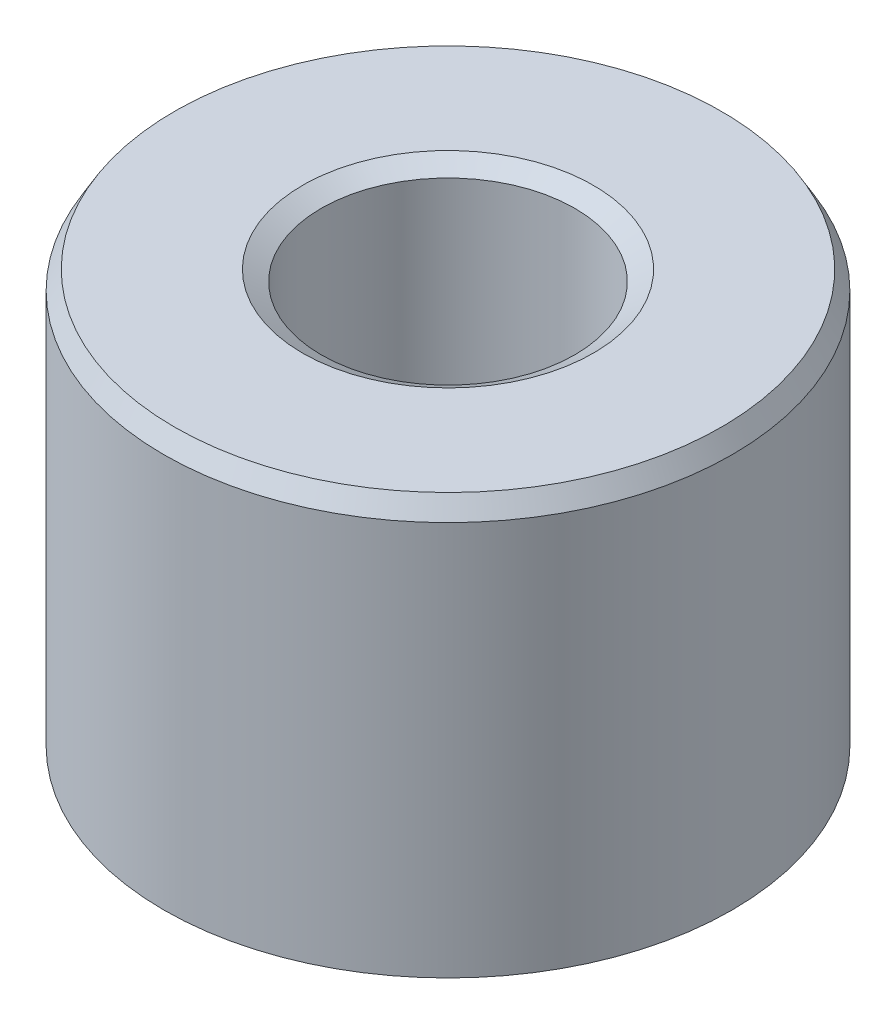
ISO-10303-21;
HEADER;
FILE_DESCRIPTION(('STEP AP214'),'2;1');
FILE_NAME('part.step','',(''),(''),'','','');
FILE_SCHEMA(('AUTOMOTIVE_DESIGN { 1 0 10303 214 1 1 1 1 }'));
ENDSEC;
DATA;
#1=APPLICATION_CONTEXT('core data for automotive mechanical design processes');
#2=APPLICATION_PROTOCOL_DEFINITION('international standard','automotive_design',2000,#1);
#3=PRODUCT_CONTEXT('',#1,'mechanical');
#4=PRODUCT('Part','Part','',(#3));
#5=PRODUCT_RELATED_PRODUCT_CATEGORY('part','',(#4));
#6=PRODUCT_DEFINITION_FORMATION('','',#4);
#7=PRODUCT_DEFINITION_CONTEXT('part definition',#1,'design');
#8=PRODUCT_DEFINITION('design','',#6,#7);
#9=PRODUCT_DEFINITION_SHAPE('','',#8);
#10=(LENGTH_UNIT() NAMED_UNIT(*) SI_UNIT(.MILLI.,.METRE.));
#11=(NAMED_UNIT(*) PLANE_ANGLE_UNIT() SI_UNIT($,.RADIAN.));
#12=(NAMED_UNIT(*) SI_UNIT($,.STERADIAN.) SOLID_ANGLE_UNIT());
#13=UNCERTAINTY_MEASURE_WITH_UNIT(LENGTH_MEASURE(1.E-05),#10,'distance_accuracy_value','');
#14=(GEOMETRIC_REPRESENTATION_CONTEXT(3) GLOBAL_UNCERTAINTY_ASSIGNED_CONTEXT((#13)) GLOBAL_UNIT_ASSIGNED_CONTEXT((#10,
#11,#12)) REPRESENTATION_CONTEXT('',''));
#15=CARTESIAN_POINT('',(0.,0.,0.));
#16=DIRECTION('',(0.,0.,1.));
#17=DIRECTION('',(1.,0.,0.));
#18=AXIS2_PLACEMENT_3D('',#15,#16,#17);
#19=CARTESIAN_POINT('',(0.,74.5253771979332,0.));
#20=DIRECTION('',(0.,-1.,0.));
#21=DIRECTION('',(0.,0.,-1.));
#22=AXIS2_PLACEMENT_3D('',#19,#20,#21);
#23=CYLINDRICAL_SURFACE('',#22,50.);
#24=CARTESIAN_POINT('',(0.,1.88266852770692,0.));
#25=DIRECTION('',(0.,1.,0.));
#26=DIRECTION('',(0.,0.,1.));
#27=AXIS2_PLACEMENT_3D('',#24,#25,#26);
#28=CIRCLE('',#27,50.);
#29=CARTESIAN_POINT('',(0.,1.88266852770692,50.));
#30=VERTEX_POINT('',#29);
#31=EDGE_CURVE('E10',#30,#30,#28,.T.);
#32=ORIENTED_EDGE('',*,*,#31,.T.);
#33=EDGE_LOOP('',(#32));
#34=FACE_BOUND('',#33,.T.);
#35=CARTESIAN_POINT('',(0.,71.2644996541339,0.));
#36=DIRECTION('',(0.,1.,0.));
#37=DIRECTION('',(0.,0.,1.));
#38=AXIS2_PLACEMENT_3D('',#35,#36,#37);
#39=CIRCLE('',#38,50.);
#40=CARTESIAN_POINT('',(0.,71.2644996541339,50.));
#41=VERTEX_POINT('',#40);
#42=EDGE_CURVE('E50',#41,#41,#39,.F.);
#43=ORIENTED_EDGE('',*,*,#42,.T.);
#44=EDGE_LOOP('',(#43));
#45=FACE_BOUND('',#44,.T.);
#46=ADVANCED_FACE('F39',(#34,#45),#23,.T.);
#47=CARTESIAN_POINT('',(0.,74.5253771979332,0.));
#48=DIRECTION('',(0.,1.,0.));
#49=DIRECTION('',(0.,0.,1.));
#50=AXIS2_PLACEMENT_3D('',#47,#48,#49);
#51=PLANE('',#50);
#52=CARTESIAN_POINT('',(0.,74.5253771979332,0.));
#53=DIRECTION('',(0.,1.,0.));
#54=DIRECTION('',(0.,0.,1.));
#55=AXIS2_PLACEMENT_3D('',#52,#53,#54);
#56=CIRCLE('',#55,25.5830901422329);
#57=CARTESIAN_POINT('',(0.,74.5253771979332,25.5830901422329));
#58=VERTEX_POINT('',#57);
#59=EDGE_CURVE('E58',#58,#58,#56,.F.);
#60=ORIENTED_EDGE('',*,*,#59,.T.);
#61=EDGE_LOOP('',(#60));
#62=FACE_BOUND('',#61,.T.);
#63=CARTESIAN_POINT('',(0.,74.5253771979332,0.));
#64=DIRECTION('',(0.,1.,0.));
#65=DIRECTION('',(0.,0.,1.));
#66=AXIS2_PLACEMENT_3D('',#63,#64,#65);
#67=CIRCLE('',#66,48.1173314722931);
#68=CARTESIAN_POINT('',(0.,74.5253771979332,48.1173314722931));
#69=VERTEX_POINT('',#68);
#70=EDGE_CURVE('E61',#69,#69,#67,.T.);
#71=ORIENTED_EDGE('',*,*,#70,.T.);
#72=EDGE_LOOP('',(#71));
#73=FACE_BOUND('',#72,.T.);
#74=ADVANCED_FACE('F88',(#62,#73),#51,.T.);
#75=CARTESIAN_POINT('',(0.,0.,0.));
#76=DIRECTION('',(0.,1.,0.));
#77=DIRECTION('',(0.,0.,1.));
#78=AXIS2_PLACEMENT_3D('',#75,#76,#77);
#79=PLANE('',#78);
#80=CARTESIAN_POINT('',(0.,0.,0.));
#81=DIRECTION('',(0.,1.,0.));
#82=DIRECTION('',(0.,0.,1.));
#83=AXIS2_PLACEMENT_3D('',#80,#81,#82);
#84=CIRCLE('',#83,24.2048811261405);
#85=CARTESIAN_POINT('',(0.,0.,-24.2048811261405));
#86=VERTEX_POINT('',#85);
#87=EDGE_CURVE('E51',#86,#86,#84,.T.);
#88=ORIENTED_EDGE('',*,*,#87,.T.);
#89=EDGE_LOOP('',(#88));
#90=FACE_BOUND('',#89,.T.);
#91=CARTESIAN_POINT('',(0.,0.,0.));
#92=DIRECTION('',(0.,1.,0.));
#93=DIRECTION('',(0.,0.,1.));
#94=AXIS2_PLACEMENT_3D('',#91,#92,#93);
#95=CIRCLE('',#94,46.7391224562007);
#96=CARTESIAN_POINT('',(0.,0.,46.7391224562007));
#97=VERTEX_POINT('',#96);
#98=EDGE_CURVE('E54',#97,#97,#95,.F.);
#99=ORIENTED_EDGE('',*,*,#98,.T.);
#100=EDGE_LOOP('',(#99));
#101=FACE_BOUND('',#100,.T.);
#102=ADVANCED_FACE('F83',(#90,#101),#79,.F.);
#103=CARTESIAN_POINT('',(0.,74.5253771979332,0.));
#104=DIRECTION('',(0.,-1.,0.));
#105=DIRECTION('',(0.,0.,-1.));
#106=AXIS2_PLACEMENT_3D('',#103,#104,#105);
#107=CYLINDRICAL_SURFACE('',#106,22.3222125984335);
#108=CARTESIAN_POINT('',(0.,72.6427086702263,0.));
#109=DIRECTION('',(0.,1.,0.));
#110=DIRECTION('',(0.,0.,1.));
#111=AXIS2_PLACEMENT_3D('',#108,#109,#110);
#112=CIRCLE('',#111,22.3222125984335);
#113=CARTESIAN_POINT('',(0.,72.6427086702263,22.3222125984335));
#114=VERTEX_POINT('',#113);
#115=EDGE_CURVE('E67',#114,#114,#112,.T.);
#116=ORIENTED_EDGE('',*,*,#115,.T.);
#117=EDGE_LOOP('',(#116));
#118=FACE_BOUND('',#117,.T.);
#119=CARTESIAN_POINT('',(0.,3.26087754379936,0.));
#120=DIRECTION('',(0.,1.,0.));
#121=DIRECTION('',(0.,0.,1.));
#122=AXIS2_PLACEMENT_3D('',#119,#120,#121);
#123=CIRCLE('',#122,22.3222125984335);
#124=CARTESIAN_POINT('',(0.,3.26087754379936,-22.3222125984335));
#125=VERTEX_POINT('',#124);
#126=EDGE_CURVE('E69',#125,#125,#123,.F.);
#127=ORIENTED_EDGE('',*,*,#126,.T.);
#128=EDGE_LOOP('',(#127));
#129=FACE_BOUND('',#128,.T.);
#130=ADVANCED_FACE('F71',(#118,#129),#107,.F.);
#131=CARTESIAN_POINT('',(0.,72.6427086702263,0.));
#132=DIRECTION('',(0.,1.,0.));
#133=DIRECTION('',(0.,0.,1.));
#134=AXIS2_PLACEMENT_3D('',#131,#132,#133);
#135=CONICAL_SURFACE('',#134,22.3222125984335,1.0471975511966);
#136=ORIENTED_EDGE('',*,*,#59,.F.);
#137=EDGE_LOOP('',(#136));
#138=FACE_BOUND('',#137,.T.);
#139=ORIENTED_EDGE('',*,*,#115,.F.);
#140=EDGE_LOOP('',(#139));
#141=FACE_BOUND('',#140,.T.);
#142=ADVANCED_FACE('F77',(#138,#141),#135,.F.);
#143=CARTESIAN_POINT('',(0.,0.,0.));
#144=DIRECTION('',(0.,-1.,0.));
#145=DIRECTION('',(0.,0.,-1.));
#146=AXIS2_PLACEMENT_3D('',#143,#144,#145);
#147=CONICAL_SURFACE('',#146,24.2048811261405,0.523598775598298);
#148=CARTESIAN_POINT('',(0.,3.26087754379936,-22.3222125984335));
#149=CARTESIAN_POINT('',(0.,3.22691006938479,-22.3418237289305));
#150=CARTESIAN_POINT('',(0.,3.19294259497021,-22.3614348594274));
#151=CARTESIAN_POINT('',(0.,3.12500764614105,-22.4006571204213));
#152=CARTESIAN_POINT('',(0.,3.09104017172648,-22.4202682509183));
#153=CARTESIAN_POINT('',(0.,3.02310522289732,-22.4594905119122));
#154=CARTESIAN_POINT('',(0.,2.98913774848275,-22.4791016424091));
#155=CARTESIAN_POINT('',(0.,2.92120279965359,-22.518323903403));
#156=CARTESIAN_POINT('',(0.,2.88723532523902,-22.5379350339));
#157=CARTESIAN_POINT('',(0.,2.81930037640986,-22.5771572948939));
#158=CARTESIAN_POINT('',(0.,2.78533290199529,-22.5967684253908));
#159=CARTESIAN_POINT('',(0.,2.71739795316613,-22.6359906863847));
#160=CARTESIAN_POINT('',(0.,2.68343047875156,-22.6556018168816));
#161=CARTESIAN_POINT('',(0.,2.6154955299224,-22.6948240778755));
#162=CARTESIAN_POINT('',(0.,2.58152805550783,-22.7144352083725));
#163=CARTESIAN_POINT('',(0.,2.51359310667867,-22.7536574693664));
#164=CARTESIAN_POINT('',(0.,2.4796256322641,-22.7732685998633));
#165=CARTESIAN_POINT('',(0.,2.41169068343494,-22.8124908608572));
#166=CARTESIAN_POINT('',(0.,2.37772320902037,-22.8321019913542));
#167=CARTESIAN_POINT('',(0.,2.30978826019121,-22.8713242523481));
#168=CARTESIAN_POINT('',(0.,2.27582078577664,-22.890935382845));
#169=CARTESIAN_POINT('',(0.,2.20788583694748,-22.9301576438389));
#170=CARTESIAN_POINT('',(0.,2.17391836253291,-22.9497687743359));
#171=CARTESIAN_POINT('',(0.,2.10598341370375,-22.9889910353298));
#172=CARTESIAN_POINT('',(0.,2.07201593928918,-23.0086021658267));
#173=CARTESIAN_POINT('',(0.,2.00408099046002,-23.0478244268206));
#174=CARTESIAN_POINT('',(0.,1.97011351604545,-23.0674355573176));
#175=CARTESIAN_POINT('',(0.,1.90217856721629,-23.1066578183114));
#176=CARTESIAN_POINT('',(0.,1.86821109280172,-23.1262689488084));
#177=CARTESIAN_POINT('',(0.,1.80027614397256,-23.1654912098023));
#178=CARTESIAN_POINT('',(0.,1.76630866955799,-23.1851023402992));
#179=CARTESIAN_POINT('',(0.,1.69837372072883,-23.2243246012931));
#180=CARTESIAN_POINT('',(0.,1.66440624631426,-23.2439357317901));
#181=CARTESIAN_POINT('',(0.,1.5964712974851,-23.283157992784));
#182=CARTESIAN_POINT('',(0.,1.56250382307053,-23.3027691232809));
#183=CARTESIAN_POINT('',(0.,1.49456887424137,-23.3419913842748));
#184=CARTESIAN_POINT('',(0.,1.4606013998268,-23.3616025147718));
#185=CARTESIAN_POINT('',(0.,1.39266645099764,-23.4008247757657));
#186=CARTESIAN_POINT('',(0.,1.35869897658307,-23.4204359062626));
#187=CARTESIAN_POINT('',(0.,1.29076402775391,-23.4596581672565));
#188=CARTESIAN_POINT('',(0.,1.25679655333934,-23.4792692977534));
#189=CARTESIAN_POINT('',(0.,1.18886160451018,-23.5184915587473));
#190=CARTESIAN_POINT('',(0.,1.15489413009561,-23.5381026892443));
#191=CARTESIAN_POINT('',(0.,1.08695918126645,-23.5773249502382));
#192=CARTESIAN_POINT('',(0.,1.05299170685188,-23.5969360807351));
#193=CARTESIAN_POINT('',(0.,0.985056758022724,-23.636158341729));
#194=CARTESIAN_POINT('',(0.,0.951089283608147,-23.655769472226));
#195=CARTESIAN_POINT('',(0.,0.883154334778994,-23.6949917332199));
#196=CARTESIAN_POINT('',(0.,0.849186860364417,-23.7146028637168));
#197=CARTESIAN_POINT('',(0.,0.781251911535263,-23.7538251247107));
#198=CARTESIAN_POINT('',(0.,0.747284437120687,-23.7734362552077));
#199=CARTESIAN_POINT('',(0.,0.679349488291534,-23.8126585162016));
#200=CARTESIAN_POINT('',(0.,0.645382013876957,-23.8322696466985));
#201=CARTESIAN_POINT('',(0.,0.577447065047803,-23.8714919076924));
#202=CARTESIAN_POINT('',(0.,0.543479590633227,-23.8911030381893));
#203=CARTESIAN_POINT('',(0.,0.475544641804074,-23.9303252991832));
#204=CARTESIAN_POINT('',(0.,0.441577167389497,-23.9499364296802));
#205=CARTESIAN_POINT('',(0.,0.373642218560343,-23.9891586906741));
#206=CARTESIAN_POINT('',(0.,0.339674744145767,-24.008769821171));
#207=CARTESIAN_POINT('',(0.,0.271739795316614,-24.0479920821649));
#208=CARTESIAN_POINT('',(0.,0.237772320902037,-24.0676032126619));
#209=CARTESIAN_POINT('',(0.,0.169837372072883,-24.1068254736558));
#210=CARTESIAN_POINT('',(0.,0.135869897658307,-24.1264366041527));
#211=CARTESIAN_POINT('',(0.,0.0679349488291539,-24.1656588651466));
#212=CARTESIAN_POINT('',(0.,0.0339674744145775,-24.1852699956436));
#213=CARTESIAN_POINT('',(0.,0.,-24.2048811261405));
#214=B_SPLINE_CURVE_WITH_KNOTS('',3,(#148,#149,#150,#151,#152,#153,#154,#155,#156,#157,#158,
#159,#160,#161,#162,#163,#164,#165,#166,#167,#168,#169,#170,#171,#172,#173,#174,#175,#176,#177,
#178,#179,#180,#181,#182,#183,#184,#185,#186,#187,#188,#189,#190,#191,#192,#193,#194,#195,#196,
#197,#198,#199,#200,#201,#202,#203,#204,#205,#206,#207,#208,#209,#210,#211,#212,#213),
.UNSPECIFIED.,.F.,.F.,(4,2,2,2,2,2,2,2,2,2,2,2,2,2,2,2,2,2,2,2,2,2,2,2,2,2,2,2,2,2,2,2,4),(0.,
0.117666782981686,0.235333565963371,0.353000348945055,0.470667131926742,0.588333914908426,
0.706000697890113,0.823667480871797,0.941334263853484,1.05900104683517,1.17666782981685,
1.29433461279854,1.41200139578022,1.52966817876191,1.6473349617436,1.76500174472528,
1.88266852770697,2.00033531068865,2.11800209367034,2.23566887665202,2.35333565963371,
2.47100244261539,2.58866922559708,2.70633600857876,2.82400279156045,2.94166957454213,
3.05933635752382,3.1770031405055,3.29466992348719,3.41233670646887,3.53000348945056,
3.64767027243225,3.76533705541393),.UNSPECIFIED.);
#215=EDGE_CURVE('BSEAM73',#125,#86,#214,.T.);
#216=ORIENTED_EDGE('',*,*,#126,.F.);
#217=ORIENTED_EDGE('',*,*,#87,.F.);
#218=ORIENTED_EDGE('',*,*,#215,.T.);
#219=ORIENTED_EDGE('',*,*,#215,.F.);
#220=EDGE_LOOP('',(#216,#218,#217,#219));
#221=FACE_BOUND('',#220,.T.);
#222=ADVANCED_FACE('F73',(#221),#147,.F.);
#223=CARTESIAN_POINT('',(0.,1.88266852770692,0.));
#224=DIRECTION('',(0.,1.,0.));
#225=DIRECTION('',(0.,0.,1.));
#226=AXIS2_PLACEMENT_3D('',#223,#224,#225);
#227=CONICAL_SURFACE('',#226,50.,1.0471975511966);
#228=CARTESIAN_POINT('',(0.,0.,46.7391224562007));
#229=CARTESIAN_POINT('',(0.,0.0196111304969486,46.7730899306152));
#230=CARTESIAN_POINT('',(0.,0.0392222609938951,46.8070574050298));
#231=CARTESIAN_POINT('',(0.,0.0784445219877882,46.874992353859));
#232=CARTESIAN_POINT('',(0.,0.0980556524847347,46.9089598282735));
#233=CARTESIAN_POINT('',(0.,0.137277913478629,46.9768947771027));
#234=CARTESIAN_POINT('',(0.,0.156889043975577,47.0108622515173));
#235=CARTESIAN_POINT('',(0.,0.196111304969471,47.0787972003464));
#236=CARTESIAN_POINT('',(0.,0.215722435466418,47.112764674761));
#237=CARTESIAN_POINT('',(0.,0.254944696460312,47.1806996235902));
#238=CARTESIAN_POINT('',(0.,0.27455582695726,47.2146670980047));
#239=CARTESIAN_POINT('',(0.,0.313778087951154,47.2826020468339));
#240=CARTESIAN_POINT('',(0.,0.3333892184481,47.3165695212485));
#241=CARTESIAN_POINT('',(0.,0.372611479441995,47.3845044700776));
#242=CARTESIAN_POINT('',(0.,0.392222609938943,47.4184719444922));
#243=CARTESIAN_POINT('',(0.,0.431444870932837,47.4864068933214));
#244=CARTESIAN_POINT('',(0.,0.451056001429783,47.5203743677359));
#245=CARTESIAN_POINT('',(0.,0.490278262423677,47.5883093165651));
#246=CARTESIAN_POINT('',(0.,0.509889392920626,47.6222767909797));
#247=CARTESIAN_POINT('',(0.,0.54911165391452,47.6902117398088));
#248=CARTESIAN_POINT('',(0.,0.568722784411466,47.7241792142234));
#249=CARTESIAN_POINT('',(0.,0.60794504540536,47.7921141630525));
#250=CARTESIAN_POINT('',(0.,0.627556175902308,47.8260816374671));
#251=CARTESIAN_POINT('',(0.,0.666778436896203,47.8940165862963));
#252=CARTESIAN_POINT('',(0.,0.686389567393149,47.9279840607108));
#253=CARTESIAN_POINT('',(0.,0.725611828387043,47.99591900954));
#254=CARTESIAN_POINT('',(0.,0.745222958883991,48.0298864839546));
#255=CARTESIAN_POINT('',(0.,0.784445219877885,48.0978214327837));
#256=CARTESIAN_POINT('',(0.,0.804056350374831,48.1317889071983));
#257=CARTESIAN_POINT('',(0.,0.843278611368726,48.1997238560274));
#258=CARTESIAN_POINT('',(0.,0.862889741865674,48.233691330442));
#259=CARTESIAN_POINT('',(0.,0.902112002859568,48.3016262792712));
#260=CARTESIAN_POINT('',(0.,0.921723133356514,48.3355937536858));
#261=CARTESIAN_POINT('',(0.,0.960945394350408,48.4035287025149));
#262=CARTESIAN_POINT('',(0.,0.980556524847357,48.4374961769295));
#263=CARTESIAN_POINT('',(0.,1.01977878584125,48.5054311257586));
#264=CARTESIAN_POINT('',(0.,1.0393899163382,48.5393986001732));
#265=CARTESIAN_POINT('',(0.,1.07861217733209,48.6073335490024));
#266=CARTESIAN_POINT('',(0.,1.09822330782904,48.6413010234169));
#267=CARTESIAN_POINT('',(0.,1.13744556882293,48.7092359722461));
#268=CARTESIAN_POINT('',(0.,1.15705669931988,48.7432034466607));
#269=CARTESIAN_POINT('',(0.,1.19627896031377,48.8111383954898));
#270=CARTESIAN_POINT('',(0.,1.21589009081072,48.8451058699044));
#271=CARTESIAN_POINT('',(0.,1.25511235180462,48.9130408187336));
#272=CARTESIAN_POINT('',(0.,1.27472348230156,48.9470082931481));
#273=CARTESIAN_POINT('',(0.,1.31394574329546,49.0149432419773));
#274=CARTESIAN_POINT('',(0.,1.3335568737924,49.0489107163919));
#275=CARTESIAN_POINT('',(0.,1.3727791347863,49.116845665221));
#276=CARTESIAN_POINT('',(0.,1.39239026528325,49.1508131396356));
#277=CARTESIAN_POINT('',(0.,1.43161252627714,49.2187480884647));
#278=CARTESIAN_POINT('',(0.,1.45122365677409,49.2527155628793));
#279=CARTESIAN_POINT('',(0.,1.49044591776798,49.3206505117085));
#280=CARTESIAN_POINT('',(0.,1.51005704826493,49.354617986123));
#281=CARTESIAN_POINT('',(0.,1.54927930925882,49.4225529349522));
#282=CARTESIAN_POINT('',(0.,1.56889043975577,49.4565204093668));
#283=CARTESIAN_POINT('',(0.,1.60811270074966,49.5244553581959));
#284=CARTESIAN_POINT('',(0.,1.62772383124661,49.5584228326105));
#285=CARTESIAN_POINT('',(0.,1.6669460922405,49.6263577814397));
#286=CARTESIAN_POINT('',(0.,1.68655722273745,49.6603252558542));
#287=CARTESIAN_POINT('',(0.,1.72577948373135,49.7282602046834));
#288=CARTESIAN_POINT('',(0.,1.74539061422829,49.762227679098));
#289=CARTESIAN_POINT('',(0.,1.78461287522219,49.8301626279271));
#290=CARTESIAN_POINT('',(0.,1.80422400571914,49.8641301023417));
#291=CARTESIAN_POINT('',(0.,1.84344626671303,49.9320650511709));
#292=CARTESIAN_POINT('',(0.,1.86305739720998,49.9660325255854));
#293=CARTESIAN_POINT('',(0.,1.88266852770692,50.));
#294=B_SPLINE_CURVE_WITH_KNOTS('',3,(#228,#229,#230,#231,#232,#233,#234,#235,#236,#237,#238,
#239,#240,#241,#242,#243,#244,#245,#246,#247,#248,#249,#250,#251,#252,#253,#254,#255,#256,#257,
#258,#259,#260,#261,#262,#263,#264,#265,#266,#267,#268,#269,#270,#271,#272,#273,#274,#275,#276,
#277,#278,#279,#280,#281,#282,#283,#284,#285,#286,#287,#288,#289,#290,#291,#292,#293),
.UNSPECIFIED.,.F.,.F.,(4,2,2,2,2,2,2,2,2,2,2,2,2,2,2,2,2,2,2,2,2,2,2,2,2,2,2,2,2,2,2,2,4),(0.,
0.117666782981681,0.235333565963368,0.353000348945049,0.470667131926736,0.588333914908417,
0.706000697890104,0.823667480871785,0.941334263853472,1.05900104683515,1.17666782981684,
1.29433461279852,1.41200139578021,1.52966817876189,1.64733496174358,1.76500174472526,
1.88266852770694,2.00033531068863,2.11800209367031,2.23566887665199,2.35333565963368,
2.47100244261536,2.58866922559705,2.70633600857873,2.82400279156042,2.9416695745421,
3.05933635752378,3.17700314050547,3.29466992348715,3.41233670646883,3.53000348945052,
3.6476702724322,3.76533705541389),.UNSPECIFIED.);
#295=EDGE_CURVE('BSEAM76',#97,#30,#294,.T.);
#296=ORIENTED_EDGE('',*,*,#98,.F.);
#297=ORIENTED_EDGE('',*,*,#31,.F.);
#298=ORIENTED_EDGE('',*,*,#295,.T.);
#299=ORIENTED_EDGE('',*,*,#295,.F.);
#300=EDGE_LOOP('',(#296,#298,#297,#299));
#301=FACE_BOUND('',#300,.T.);
#302=ADVANCED_FACE('F76',(#301),#227,.T.);
#303=CARTESIAN_POINT('',(0.,74.5253771979332,0.));
#304=DIRECTION('',(0.,-1.,0.));
#305=DIRECTION('',(0.,0.,-1.));
#306=AXIS2_PLACEMENT_3D('',#303,#304,#305);
#307=CONICAL_SURFACE('',#306,48.1173314722931,0.523598775598296);
#308=ORIENTED_EDGE('',*,*,#42,.F.);
#309=EDGE_LOOP('',(#308));
#310=FACE_BOUND('',#309,.T.);
#311=ORIENTED_EDGE('',*,*,#70,.F.);
#312=EDGE_LOOP('',(#311));
#313=FACE_BOUND('',#312,.T.);
#314=ADVANCED_FACE('F45',(#310,#313),#307,.T.);
#315=CLOSED_SHELL('',(#46,#74,#102,#130,#142,#222,#302,#314));
#316=MANIFOLD_SOLID_BREP('B2',#315);
#317=ADVANCED_BREP_SHAPE_REPRESENTATION('',(#18,#316),#14);
#318=SHAPE_DEFINITION_REPRESENTATION(#9,#317);
ENDSEC;
END-ISO-10303-21;
